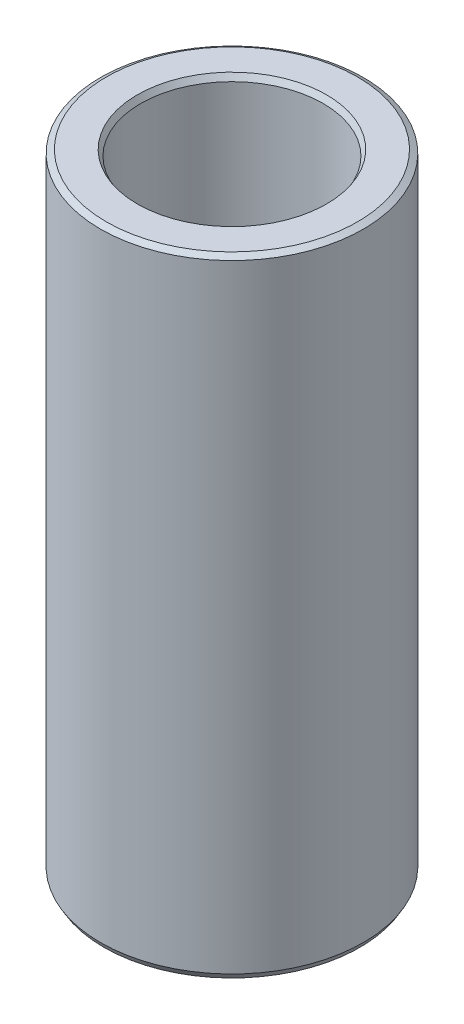
ISO-10303-21;
HEADER;
FILE_DESCRIPTION(('STEP AP214'),'2;1');
FILE_NAME('part.step','',(''),(''),'','','');
FILE_SCHEMA(('AUTOMOTIVE_DESIGN { 1 0 10303 214 1 1 1 1 }'));
ENDSEC;
DATA;
#1=APPLICATION_CONTEXT('core data for automotive mechanical design processes');
#2=APPLICATION_PROTOCOL_DEFINITION('international standard','automotive_design',2000,#1);
#3=PRODUCT_CONTEXT('',#1,'mechanical');
#4=PRODUCT('Part','Part','',(#3));
#5=PRODUCT_RELATED_PRODUCT_CATEGORY('part','',(#4));
#6=PRODUCT_DEFINITION_FORMATION('','',#4);
#7=PRODUCT_DEFINITION_CONTEXT('part definition',#1,'design');
#8=PRODUCT_DEFINITION('design','',#6,#7);
#9=PRODUCT_DEFINITION_SHAPE('','',#8);
#10=(LENGTH_UNIT() NAMED_UNIT(*) SI_UNIT(.MILLI.,.METRE.));
#11=(NAMED_UNIT(*) PLANE_ANGLE_UNIT() SI_UNIT($,.RADIAN.));
#12=(NAMED_UNIT(*) SI_UNIT($,.STERADIAN.) SOLID_ANGLE_UNIT());
#13=UNCERTAINTY_MEASURE_WITH_UNIT(LENGTH_MEASURE(1.E-05),#10,'distance_accuracy_value','');
#14=(GEOMETRIC_REPRESENTATION_CONTEXT(3) GLOBAL_UNCERTAINTY_ASSIGNED_CONTEXT((#13)) GLOBAL_UNIT_ASSIGNED_CONTEXT((#10,
#11,#12)) REPRESENTATION_CONTEXT('',''));
#15=CARTESIAN_POINT('',(0.,0.,0.));
#16=DIRECTION('',(0.,0.,1.));
#17=DIRECTION('',(1.,0.,0.));
#18=AXIS2_PLACEMENT_3D('',#15,#16,#17);
#19=CARTESIAN_POINT('',(0.,226.664433489722,0.));
#20=DIRECTION('',(0.,-1.,0.));
#21=DIRECTION('',(0.,0.,-1.));
#22=AXIS2_PLACEMENT_3D('',#19,#20,#21);
#23=CYLINDRICAL_SURFACE('',#22,47.5);
#24=CARTESIAN_POINT('',(0.,2.11373665714998,0.));
#25=DIRECTION('',(0.,1.,0.));
#26=DIRECTION('',(0.,0.,1.));
#27=AXIS2_PLACEMENT_3D('',#24,#25,#26);
#28=CIRCLE('',#27,47.5);
#29=CARTESIAN_POINT('',(0.,2.11373665714998,47.5));
#30=VERTEX_POINT('',#29);
#31=EDGE_CURVE('E10',#30,#30,#28,.T.);
#32=ORIENTED_EDGE('',*,*,#31,.T.);
#33=EDGE_LOOP('',(#32));
#34=FACE_BOUND('',#33,.T.);
#35=CARTESIAN_POINT('',(0.,225.444067061721,0.));
#36=DIRECTION('',(0.,1.,0.));
#37=DIRECTION('',(0.,0.,1.));
#38=AXIS2_PLACEMENT_3D('',#35,#36,#37);
#39=CIRCLE('',#38,47.5);
#40=CARTESIAN_POINT('',(0.,225.444067061721,47.5));
#41=VERTEX_POINT('',#40);
#42=EDGE_CURVE('E50',#41,#41,#39,.F.);
#43=ORIENTED_EDGE('',*,*,#42,.T.);
#44=EDGE_LOOP('',(#43));
#45=FACE_BOUND('',#44,.T.);
#46=ADVANCED_FACE('F39',(#34,#45),#23,.T.);
#47=CARTESIAN_POINT('',(0.,226.664433489722,0.));
#48=DIRECTION('',(0.,1.,0.));
#49=DIRECTION('',(0.,0.,1.));
#50=AXIS2_PLACEMENT_3D('',#47,#48,#49);
#51=PLANE('',#50);
#52=CARTESIAN_POINT('',(0.,226.664433489722,0.));
#53=DIRECTION('',(0.,1.,0.));
#54=DIRECTION('',(0.,0.,1.));
#55=AXIS2_PLACEMENT_3D('',#52,#53,#54);
#56=CIRCLE('',#55,34.2009500173009);
#57=CARTESIAN_POINT('',(0.,226.664433489722,34.2009500173009));
#58=VERTEX_POINT('',#57);
#59=EDGE_CURVE('E58',#58,#58,#56,.F.);
#60=ORIENTED_EDGE('',*,*,#59,.T.);
#61=EDGE_LOOP('',(#60));
#62=FACE_BOUND('',#61,.T.);
#63=CARTESIAN_POINT('',(0.,226.664433489722,0.));
#64=DIRECTION('',(0.,1.,0.));
#65=DIRECTION('',(0.,0.,1.));
#66=AXIS2_PLACEMENT_3D('',#63,#64,#65);
#67=CIRCLE('',#66,45.3862633428501);
#68=CARTESIAN_POINT('',(0.,226.664433489722,45.3862633428501));
#69=VERTEX_POINT('',#68);
#70=EDGE_CURVE('E61',#69,#69,#67,.T.);
#71=ORIENTED_EDGE('',*,*,#70,.T.);
#72=EDGE_LOOP('',(#71));
#73=FACE_BOUND('',#72,.T.);
#74=ADVANCED_FACE('F88',(#62,#73),#51,.T.);
#75=CARTESIAN_POINT('',(0.,0.,0.));
#76=DIRECTION('',(0.,1.,0.));
#77=DIRECTION('',(0.,0.,1.));
#78=AXIS2_PLACEMENT_3D('',#75,#76,#77);
#79=PLANE('',#78);
#80=CARTESIAN_POINT('',(0.,0.,0.));
#81=DIRECTION('',(0.,1.,0.));
#82=DIRECTION('',(0.,0.,1.));
#83=AXIS2_PLACEMENT_3D('',#80,#81,#82);
#84=CIRCLE('',#83,35.0943202464492);
#85=CARTESIAN_POINT('',(0.,0.,35.0943202464492));
#86=VERTEX_POINT('',#85);
#87=EDGE_CURVE('E51',#86,#86,#84,.T.);
#88=ORIENTED_EDGE('',*,*,#87,.T.);
#89=EDGE_LOOP('',(#88));
#90=FACE_BOUND('',#89,.T.);
#91=CARTESIAN_POINT('',(0.,0.,0.));
#92=DIRECTION('',(0.,1.,0.));
#93=DIRECTION('',(0.,0.,1.));
#94=AXIS2_PLACEMENT_3D('',#91,#92,#93);
#95=CIRCLE('',#94,46.2796335719985);
#96=CARTESIAN_POINT('',(0.,0.,46.2796335719985));
#97=VERTEX_POINT('',#96);
#98=EDGE_CURVE('E54',#97,#97,#95,.F.);
#99=ORIENTED_EDGE('',*,*,#98,.T.);
#100=EDGE_LOOP('',(#99));
#101=FACE_BOUND('',#100,.T.);
#102=ADVANCED_FACE('F83',(#90,#101),#79,.F.);
#103=CARTESIAN_POINT('',(0.,226.664433489722,0.));
#104=DIRECTION('',(0.,-1.,0.));
#105=DIRECTION('',(0.,0.,-1.));
#106=AXIS2_PLACEMENT_3D('',#103,#104,#105);
#107=CYLINDRICAL_SURFACE('',#106,32.9805835892993);
#108=CARTESIAN_POINT('',(0.,224.550696832572,0.));
#109=DIRECTION('',(0.,1.,0.));
#110=DIRECTION('',(0.,0.,1.));
#111=AXIS2_PLACEMENT_3D('',#108,#109,#110);
#112=CIRCLE('',#111,32.9805835892993);
#113=CARTESIAN_POINT('',(0.,224.550696832572,32.9805835892993));
#114=VERTEX_POINT('',#113);
#115=EDGE_CURVE('E67',#114,#114,#112,.T.);
#116=ORIENTED_EDGE('',*,*,#115,.T.);
#117=EDGE_LOOP('',(#116));
#118=FACE_BOUND('',#117,.T.);
#119=CARTESIAN_POINT('',(0.,1.22036642800147,0.));
#120=DIRECTION('',(0.,1.,0.));
#121=DIRECTION('',(0.,0.,1.));
#122=AXIS2_PLACEMENT_3D('',#119,#120,#121);
#123=CIRCLE('',#122,32.9805835892993);
#124=CARTESIAN_POINT('',(0.,1.22036642800147,32.9805835892993));
#125=VERTEX_POINT('',#124);
#126=EDGE_CURVE('E69',#125,#125,#123,.F.);
#127=ORIENTED_EDGE('',*,*,#126,.T.);
#128=EDGE_LOOP('',(#127));
#129=FACE_BOUND('',#128,.T.);
#130=ADVANCED_FACE('F71',(#118,#129),#107,.F.);
#131=CARTESIAN_POINT('',(0.,224.550696832572,0.));
#132=DIRECTION('',(0.,1.,0.));
#133=DIRECTION('',(0.,0.,1.));
#134=AXIS2_PLACEMENT_3D('',#131,#132,#133);
#135=CONICAL_SURFACE('',#134,32.9805835892993,0.52359877559829);
#136=ORIENTED_EDGE('',*,*,#59,.F.);
#137=EDGE_LOOP('',(#136));
#138=FACE_BOUND('',#137,.T.);
#139=ORIENTED_EDGE('',*,*,#115,.F.);
#140=EDGE_LOOP('',(#139));
#141=FACE_BOUND('',#140,.T.);
#142=ADVANCED_FACE('F77',(#138,#141),#135,.F.);
#143=CARTESIAN_POINT('',(0.,0.,0.));
#144=DIRECTION('',(0.,-1.,0.));
#145=DIRECTION('',(0.,0.,-1.));
#146=AXIS2_PLACEMENT_3D('',#143,#144,#145);
#147=CONICAL_SURFACE('',#146,35.0943202464492,1.04719755119659);
#148=ORIENTED_EDGE('',*,*,#126,.F.);
#149=EDGE_LOOP('',(#148));
#150=FACE_BOUND('',#149,.T.);
#151=ORIENTED_EDGE('',*,*,#87,.F.);
#152=EDGE_LOOP('',(#151));
#153=FACE_BOUND('',#152,.T.);
#154=ADVANCED_FACE('F73',(#150,#153),#147,.F.);
#155=CARTESIAN_POINT('',(0.,2.11373665714998,0.));
#156=DIRECTION('',(0.,1.,0.));
#157=DIRECTION('',(0.,0.,1.));
#158=AXIS2_PLACEMENT_3D('',#155,#156,#157);
#159=CONICAL_SURFACE('',#158,47.5,0.523598775598293);
#160=ORIENTED_EDGE('',*,*,#98,.F.);
#161=EDGE_LOOP('',(#160));
#162=FACE_BOUND('',#161,.T.);
#163=ORIENTED_EDGE('',*,*,#31,.F.);
#164=EDGE_LOOP('',(#163));
#165=FACE_BOUND('',#164,.T.);
#166=ADVANCED_FACE('F76',(#162,#165),#159,.T.);
#167=CARTESIAN_POINT('',(0.,226.664433489722,0.));
#168=DIRECTION('',(0.,-1.,0.));
#169=DIRECTION('',(0.,0.,-1.));
#170=AXIS2_PLACEMENT_3D('',#167,#168,#169);
#171=CONICAL_SURFACE('',#170,45.3862633428501,1.04719755119658);
#172=ORIENTED_EDGE('',*,*,#42,.F.);
#173=EDGE_LOOP('',(#172));
#174=FACE_BOUND('',#173,.T.);
#175=ORIENTED_EDGE('',*,*,#70,.F.);
#176=EDGE_LOOP('',(#175));
#177=FACE_BOUND('',#176,.T.);
#178=ADVANCED_FACE('F45',(#174,#177),#171,.T.);
#179=CLOSED_SHELL('',(#46,#74,#102,#130,#142,#154,#166,#178));
#180=MANIFOLD_SOLID_BREP('B2',#179);
#181=ADVANCED_BREP_SHAPE_REPRESENTATION('',(#18,#180),#14);
#182=SHAPE_DEFINITION_REPRESENTATION(#9,#181);
ENDSEC;
END-ISO-10303-21;
